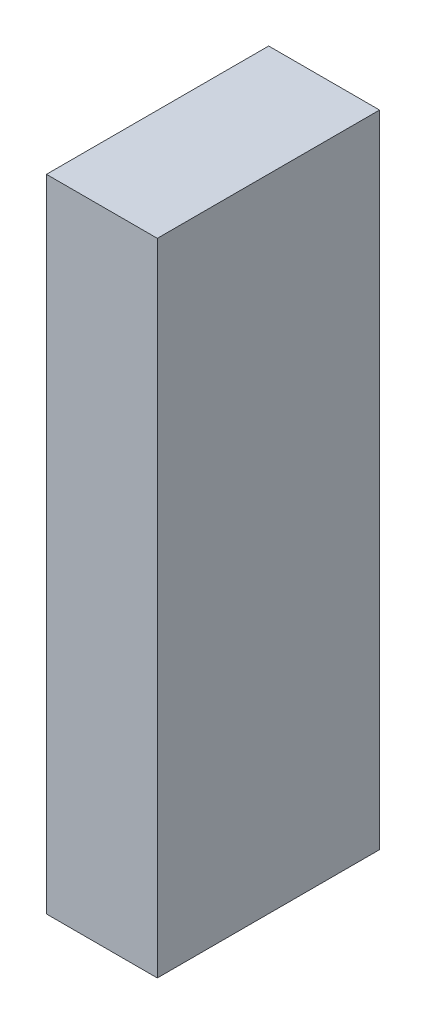
ISO-10303-21;
HEADER;
FILE_DESCRIPTION(('STEP AP214'),'2;1');
FILE_NAME('part.step','',(''),(''),'','','');
FILE_SCHEMA(('AUTOMOTIVE_DESIGN { 1 0 10303 214 1 1 1 1 }'));
ENDSEC;
DATA;
#1=APPLICATION_CONTEXT('core data for automotive mechanical design processes');
#2=APPLICATION_PROTOCOL_DEFINITION('international standard','automotive_design',2000,#1);
#3=PRODUCT_CONTEXT('',#1,'mechanical');
#4=PRODUCT('Part','Part','',(#3));
#5=PRODUCT_RELATED_PRODUCT_CATEGORY('part','',(#4));
#6=PRODUCT_DEFINITION_FORMATION('','',#4);
#7=PRODUCT_DEFINITION_CONTEXT('part definition',#1,'design');
#8=PRODUCT_DEFINITION('design','',#6,#7);
#9=PRODUCT_DEFINITION_SHAPE('','',#8);
#10=(LENGTH_UNIT() NAMED_UNIT(*) SI_UNIT(.MILLI.,.METRE.));
#11=(NAMED_UNIT(*) PLANE_ANGLE_UNIT() SI_UNIT($,.RADIAN.));
#12=(NAMED_UNIT(*) SI_UNIT($,.STERADIAN.) SOLID_ANGLE_UNIT());
#13=UNCERTAINTY_MEASURE_WITH_UNIT(LENGTH_MEASURE(1.E-05),#10,'distance_accuracy_value','');
#14=(GEOMETRIC_REPRESENTATION_CONTEXT(3) GLOBAL_UNCERTAINTY_ASSIGNED_CONTEXT((#13)) GLOBAL_UNIT_ASSIGNED_CONTEXT((#10,
#11,#12)) REPRESENTATION_CONTEXT('',''));
#15=CARTESIAN_POINT('',(0.,0.,0.));
#16=DIRECTION('',(0.,0.,1.));
#17=DIRECTION('',(1.,0.,0.));
#18=AXIS2_PLACEMENT_3D('',#15,#16,#17);
#19=CARTESIAN_POINT('',(-0.11250168,-0.6499987,0.));
#20=DIRECTION('',(-1.,0.,0.));
#21=DIRECTION('',(0.,0.,1.));
#22=AXIS2_PLACEMENT_3D('',#19,#20,#21);
#23=PLANE('',#22);
#24=DIRECTION('',(0.,0.,1.));
#25=VECTOR('',#24,1.);
#26=CARTESIAN_POINT('',(-0.11250168,0.65000124,0.));
#27=LINE('',#26,#25);
#28=CARTESIAN_POINT('',(-0.11250168,0.65000124,0.));
#29=VERTEX_POINT('',#28);
#30=CARTESIAN_POINT('',(-0.11250168,0.65000124,0.45099986));
#31=VERTEX_POINT('',#30);
#32=EDGE_CURVE('E59',#29,#31,#27,.T.);
#33=ORIENTED_EDGE('',*,*,#32,.F.);
#34=DIRECTION('',(0.,1.,0.));
#35=VECTOR('',#34,1.);
#36=CARTESIAN_POINT('',(-0.11250168,-0.6499987,0.));
#37=LINE('',#36,#35);
#38=CARTESIAN_POINT('',(-0.11250168,-0.6499987,0.));
#39=VERTEX_POINT('',#38);
#40=EDGE_CURVE('E74',#29,#39,#37,.F.);
#41=ORIENTED_EDGE('',*,*,#40,.T.);
#42=DIRECTION('',(0.,0.,-1.));
#43=VECTOR('',#42,1.);
#44=CARTESIAN_POINT('',(-0.11250168,-0.6499987,0.));
#45=LINE('',#44,#43);
#46=CARTESIAN_POINT('',(-0.11250168,-0.6499987,0.45099986));
#47=VERTEX_POINT('',#46);
#48=EDGE_CURVE('E81',#47,#39,#45,.T.);
#49=ORIENTED_EDGE('',*,*,#48,.F.);
#50=DIRECTION('',(0.,1.,0.));
#51=VECTOR('',#50,1.);
#52=CARTESIAN_POINT('',(-0.11250168,-0.6499987,0.45099986));
#53=LINE('',#52,#51);
#54=EDGE_CURVE('E63',#31,#47,#53,.F.);
#55=ORIENTED_EDGE('',*,*,#54,.F.);
#56=EDGE_LOOP('',(#33,#41,#49,#55));
#57=FACE_BOUND('',#56,.T.);
#58=ADVANCED_FACE('F16',(#57),#23,.T.);
#59=CARTESIAN_POINT('',(-0.11250168,0.65000124,0.));
#60=DIRECTION('',(0.,1.,0.));
#61=DIRECTION('',(0.,0.,1.));
#62=AXIS2_PLACEMENT_3D('',#59,#60,#61);
#63=PLANE('',#62);
#64=DIRECTION('',(0.,0.,1.));
#65=VECTOR('',#64,1.);
#66=CARTESIAN_POINT('',(0.11250422,0.65000124,0.));
#67=LINE('',#66,#65);
#68=CARTESIAN_POINT('',(0.11250422,0.65000124,0.));
#69=VERTEX_POINT('',#68);
#70=CARTESIAN_POINT('',(0.11250422,0.65000124,0.45099986));
#71=VERTEX_POINT('',#70);
#72=EDGE_CURVE('E57',#69,#71,#67,.T.);
#73=ORIENTED_EDGE('',*,*,#72,.F.);
#74=DIRECTION('',(1.,0.,0.));
#75=VECTOR('',#74,1.);
#76=CARTESIAN_POINT('',(-0.11250168,0.65000124,0.));
#77=LINE('',#76,#75);
#78=EDGE_CURVE('E85',#69,#29,#77,.F.);
#79=ORIENTED_EDGE('',*,*,#78,.T.);
#80=ORIENTED_EDGE('',*,*,#32,.T.);
#81=DIRECTION('',(1.,0.,0.));
#82=VECTOR('',#81,1.);
#83=CARTESIAN_POINT('',(0.1124966,0.65000124,0.45099986));
#84=LINE('',#83,#82);
#85=EDGE_CURVE('E19',#71,#31,#84,.F.);
#86=ORIENTED_EDGE('',*,*,#85,.F.);
#87=EDGE_LOOP('',(#73,#79,#80,#86));
#88=FACE_BOUND('',#87,.T.);
#89=ADVANCED_FACE('F54',(#88),#63,.T.);
#90=CARTESIAN_POINT('',(0.1124966,-0.6499987,0.45099986));
#91=DIRECTION('',(0.,0.,1.));
#92=DIRECTION('',(1.,0.,0.));
#93=AXIS2_PLACEMENT_3D('',#90,#91,#92);
#94=PLANE('',#93);
#95=ORIENTED_EDGE('',*,*,#54,.T.);
#96=DIRECTION('',(1.,0.,0.));
#97=VECTOR('',#96,1.);
#98=CARTESIAN_POINT('',(0.1124966,-0.6499987,0.45099986));
#99=LINE('',#98,#97);
#100=CARTESIAN_POINT('',(0.112496600000009,-0.6499987,0.45099986));
#101=VERTEX_POINT('',#100);
#102=EDGE_CURVE('E68',#101,#47,#99,.F.);
#103=ORIENTED_EDGE('',*,*,#102,.F.);
#104=DIRECTION('',(5.86153872503995E-06,0.999999999982821,0.));
#105=VECTOR('',#104,1.);
#106=CARTESIAN_POINT('',(0.11250422,0.65000124,0.45099986));
#107=LINE('',#106,#105);
#108=EDGE_CURVE('E65',#71,#101,#107,.F.);
#109=ORIENTED_EDGE('',*,*,#108,.F.);
#110=ORIENTED_EDGE('',*,*,#85,.T.);
#111=EDGE_LOOP('',(#95,#103,#109,#110));
#112=FACE_BOUND('',#111,.T.);
#113=ADVANCED_FACE('F66',(#112),#94,.T.);
#114=CARTESIAN_POINT('',(0.1124966,-0.6499987,0.));
#115=DIRECTION('',(0.,-1.,0.));
#116=DIRECTION('',(0.,0.,-1.));
#117=AXIS2_PLACEMENT_3D('',#114,#115,#116);
#118=PLANE('',#117);
#119=ORIENTED_EDGE('',*,*,#48,.T.);
#120=DIRECTION('',(1.,0.,0.));
#121=VECTOR('',#120,1.);
#122=CARTESIAN_POINT('',(0.1124966,-0.6499987,0.));
#123=LINE('',#122,#121);
#124=CARTESIAN_POINT('',(0.112496600000009,-0.6499987,0.));
#125=VERTEX_POINT('',#124);
#126=EDGE_CURVE('E34',#39,#125,#123,.T.);
#127=ORIENTED_EDGE('',*,*,#126,.T.);
#128=DIRECTION('',(0.,0.,1.));
#129=VECTOR('',#128,1.);
#130=CARTESIAN_POINT('',(0.112496600000009,-0.6499987,0.));
#131=LINE('',#130,#129);
#132=EDGE_CURVE('E25',#101,#125,#131,.F.);
#133=ORIENTED_EDGE('',*,*,#132,.F.);
#134=ORIENTED_EDGE('',*,*,#102,.T.);
#135=EDGE_LOOP('',(#119,#127,#133,#134));
#136=FACE_BOUND('',#135,.T.);
#137=ADVANCED_FACE('F100',(#136),#118,.T.);
#138=CARTESIAN_POINT('',(0.1124966,-0.6499987,0.));
#139=DIRECTION('',(0.,0.,1.));
#140=DIRECTION('',(1.,0.,0.));
#141=AXIS2_PLACEMENT_3D('',#138,#139,#140);
#142=PLANE('',#141);
#143=ORIENTED_EDGE('',*,*,#40,.F.);
#144=ORIENTED_EDGE('',*,*,#78,.F.);
#145=DIRECTION('',(5.86153872503995E-06,0.999999999982821,0.));
#146=VECTOR('',#145,1.);
#147=CARTESIAN_POINT('',(0.11250422,0.65000124,0.));
#148=LINE('',#147,#146);
#149=EDGE_CURVE('E11',#125,#69,#148,.T.);
#150=ORIENTED_EDGE('',*,*,#149,.F.);
#151=ORIENTED_EDGE('',*,*,#126,.F.);
#152=EDGE_LOOP('',(#143,#144,#150,#151));
#153=FACE_BOUND('',#152,.T.);
#154=ADVANCED_FACE('F97',(#153),#142,.F.);
#155=CARTESIAN_POINT('',(0.11250422,0.65000124,0.));
#156=DIRECTION('',(0.999999999982821,-5.86153872503995E-06,0.));
#157=DIRECTION('',(5.86153872503995E-06,0.999999999982821,0.));
#158=AXIS2_PLACEMENT_3D('',#155,#156,#157);
#159=PLANE('',#158);
#160=ORIENTED_EDGE('',*,*,#132,.T.);
#161=ORIENTED_EDGE('',*,*,#149,.T.);
#162=ORIENTED_EDGE('',*,*,#72,.T.);
#163=ORIENTED_EDGE('',*,*,#108,.T.);
#164=EDGE_LOOP('',(#160,#161,#162,#163));
#165=FACE_BOUND('',#164,.T.);
#166=ADVANCED_FACE('F72',(#165),#159,.T.);
#167=CLOSED_SHELL('',(#58,#89,#113,#137,#154,#166));
#168=MANIFOLD_SOLID_BREP('B1',#167);
#169=ADVANCED_BREP_SHAPE_REPRESENTATION('',(#18,#168),#14);
#170=SHAPE_DEFINITION_REPRESENTATION(#9,#169);
ENDSEC;
END-ISO-10303-21;
